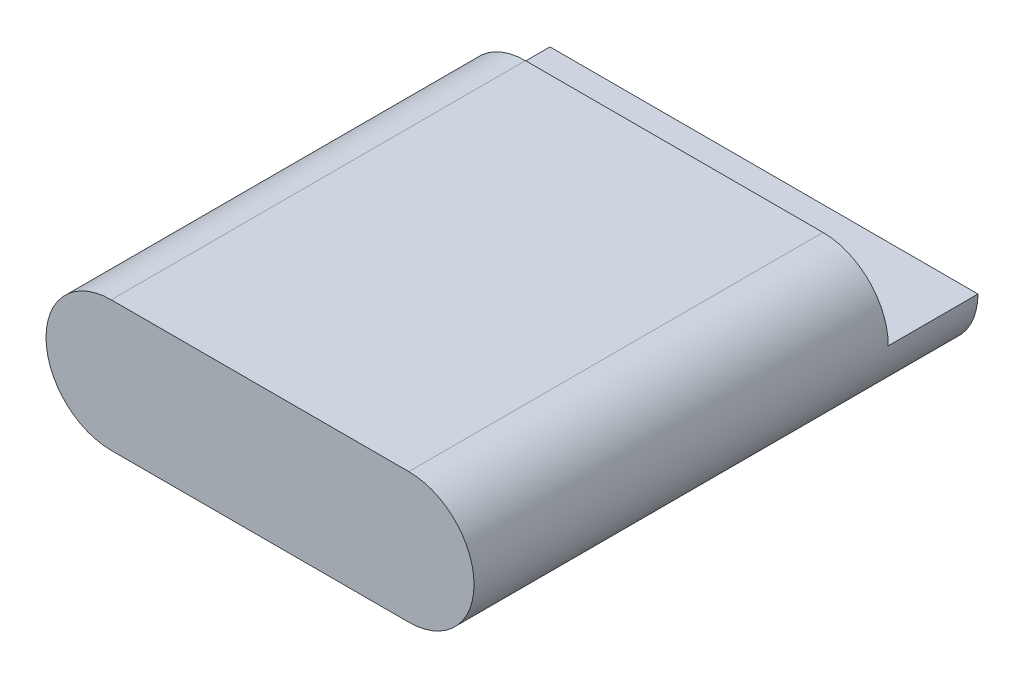
ISO-10303-21;
HEADER;
FILE_DESCRIPTION(('STEP AP214'),'2;1');
FILE_NAME('part.step','',(''),(''),'','','');
FILE_SCHEMA(('AUTOMOTIVE_DESIGN { 1 0 10303 214 1 1 1 1 }'));
ENDSEC;
DATA;
#1=APPLICATION_CONTEXT('core data for automotive mechanical design processes');
#2=APPLICATION_PROTOCOL_DEFINITION('international standard','automotive_design',2000,#1);
#3=PRODUCT_CONTEXT('',#1,'mechanical');
#4=PRODUCT('Part','Part','',(#3));
#5=PRODUCT_RELATED_PRODUCT_CATEGORY('part','',(#4));
#6=PRODUCT_DEFINITION_FORMATION('','',#4);
#7=PRODUCT_DEFINITION_CONTEXT('part definition',#1,'design');
#8=PRODUCT_DEFINITION('design','',#6,#7);
#9=PRODUCT_DEFINITION_SHAPE('','',#8);
#10=(LENGTH_UNIT() NAMED_UNIT(*) SI_UNIT(.MILLI.,.METRE.));
#11=(NAMED_UNIT(*) PLANE_ANGLE_UNIT() SI_UNIT($,.RADIAN.));
#12=(NAMED_UNIT(*) SI_UNIT($,.STERADIAN.) SOLID_ANGLE_UNIT());
#13=UNCERTAINTY_MEASURE_WITH_UNIT(LENGTH_MEASURE(1.E-05),#10,'distance_accuracy_value','');
#14=(GEOMETRIC_REPRESENTATION_CONTEXT(3) GLOBAL_UNCERTAINTY_ASSIGNED_CONTEXT((#13)) GLOBAL_UNIT_ASSIGNED_CONTEXT((#10,
#11,#12)) REPRESENTATION_CONTEXT('',''));
#15=CARTESIAN_POINT('',(0.,0.,0.));
#16=DIRECTION('',(0.,0.,1.));
#17=DIRECTION('',(1.,0.,0.));
#18=AXIS2_PLACEMENT_3D('',#15,#16,#17);
#19=CARTESIAN_POINT('',(-10.775,4.725,36.5));
#20=DIRECTION('',(0.,-1.,0.));
#21=DIRECTION('',(0.,0.,-1.));
#22=AXIS2_PLACEMENT_3D('',#19,#20,#21);
#23=PLANE('',#22);
#24=DIRECTION('',(1.,0.,0.));
#25=VECTOR('',#24,1.);
#26=CARTESIAN_POINT('',(10.775,4.725,6.5));
#27=LINE('',#26,#25);
#28=CARTESIAN_POINT('',(-10.775,4.725,6.5));
#29=VERTEX_POINT('',#28);
#30=CARTESIAN_POINT('',(10.775,4.725,6.5));
#31=VERTEX_POINT('',#30);
#32=EDGE_CURVE('E109',#29,#31,#27,.T.);
#33=ORIENTED_EDGE('',*,*,#32,.F.);
#34=DIRECTION('',(0.,0.,-1.));
#35=VECTOR('',#34,1.);
#36=CARTESIAN_POINT('',(-10.775,4.725,36.5));
#37=LINE('',#36,#35);
#38=CARTESIAN_POINT('',(-10.775,4.725,36.5));
#39=VERTEX_POINT('',#38);
#40=EDGE_CURVE('E131',#39,#29,#37,.T.);
#41=ORIENTED_EDGE('',*,*,#40,.F.);
#42=DIRECTION('',(-1.,0.,0.));
#43=VECTOR('',#42,1.);
#44=CARTESIAN_POINT('',(-10.775,4.725,36.5));
#45=LINE('',#44,#43);
#46=CARTESIAN_POINT('',(10.775,4.725,36.5));
#47=VERTEX_POINT('',#46);
#48=EDGE_CURVE('E62',#47,#39,#45,.T.);
#49=ORIENTED_EDGE('',*,*,#48,.F.);
#50=DIRECTION('',(0.,0.,-1.));
#51=VECTOR('',#50,1.);
#52=CARTESIAN_POINT('',(10.775,4.725,36.5));
#53=LINE('',#52,#51);
#54=EDGE_CURVE('E137',#47,#31,#53,.T.);
#55=ORIENTED_EDGE('',*,*,#54,.T.);
#56=EDGE_LOOP('',(#33,#41,#49,#55));
#57=FACE_BOUND('',#56,.T.);
#58=ADVANCED_FACE('F38',(#57),#23,.F.);
#59=CARTESIAN_POINT('',(-10.775,0.,36.5));
#60=DIRECTION('',(0.,0.,-1.));
#61=DIRECTION('',(-1.,0.,0.));
#62=AXIS2_PLACEMENT_3D('',#59,#60,#61);
#63=CYLINDRICAL_SURFACE('',#62,4.725);
#64=CARTESIAN_POINT('',(-10.775,0.,6.5));
#65=DIRECTION('',(0.,0.,-1.));
#66=DIRECTION('',(1.,0.,0.));
#67=AXIS2_PLACEMENT_3D('',#64,#65,#66);
#68=CIRCLE('',#67,4.72500000000001);
#69=CARTESIAN_POINT('',(-15.499933861971,-0.0249999999999926,6.5));
#70=VERTEX_POINT('',#69);
#71=EDGE_CURVE('E103',#70,#29,#68,.T.);
#72=ORIENTED_EDGE('',*,*,#71,.F.);
#73=DIRECTION('',(0.,0.,-1.));
#74=VECTOR('',#73,1.);
#75=CARTESIAN_POINT('',(-15.499933861971,-0.0249999999999926,6.5));
#76=LINE('',#75,#74);
#77=CARTESIAN_POINT('',(-15.499933861971,-0.0249999999999926,0.));
#78=VERTEX_POINT('',#77);
#79=EDGE_CURVE('E100',#70,#78,#76,.T.);
#80=ORIENTED_EDGE('',*,*,#79,.T.);
#81=CARTESIAN_POINT('',(-10.775,0.,0.));
#82=DIRECTION('',(0.,0.,1.));
#83=DIRECTION('',(1.,0.,0.));
#84=AXIS2_PLACEMENT_3D('',#81,#82,#83);
#85=CIRCLE('',#84,4.725);
#86=CARTESIAN_POINT('',(-10.775,-4.725,0.));
#87=VERTEX_POINT('',#86);
#88=EDGE_CURVE('E120',#78,#87,#85,.T.);
#89=ORIENTED_EDGE('',*,*,#88,.T.);
#90=DIRECTION('',(0.,0.,-1.));
#91=VECTOR('',#90,1.);
#92=CARTESIAN_POINT('',(-10.775,-4.725,36.5));
#93=LINE('',#92,#91);
#94=CARTESIAN_POINT('',(-10.775,-4.725,36.5));
#95=VERTEX_POINT('',#94);
#96=EDGE_CURVE('E11',#95,#87,#93,.T.);
#97=ORIENTED_EDGE('',*,*,#96,.F.);
#98=CARTESIAN_POINT('',(-10.775,0.,36.5));
#99=DIRECTION('',(0.,0.,1.));
#100=DIRECTION('',(1.,0.,0.));
#101=AXIS2_PLACEMENT_3D('',#98,#99,#100);
#102=CIRCLE('',#101,4.725);
#103=EDGE_CURVE('E125',#39,#95,#102,.T.);
#104=ORIENTED_EDGE('',*,*,#103,.F.);
#105=ORIENTED_EDGE('',*,*,#40,.T.);
#106=EDGE_LOOP('',(#72,#80,#89,#97,#104,#105));
#107=FACE_BOUND('',#106,.T.);
#108=ADVANCED_FACE('F40',(#107),#63,.T.);
#109=CARTESIAN_POINT('',(-10.775,-4.725,36.5));
#110=DIRECTION('',(0.,1.,0.));
#111=DIRECTION('',(0.,0.,1.));
#112=AXIS2_PLACEMENT_3D('',#109,#110,#111);
#113=PLANE('',#112);
#114=DIRECTION('',(1.,0.,0.));
#115=VECTOR('',#114,1.);
#116=CARTESIAN_POINT('',(-10.775,-4.725,0.));
#117=LINE('',#116,#115);
#118=CARTESIAN_POINT('',(10.775,-4.72500000000001,0.));
#119=VERTEX_POINT('',#118);
#120=EDGE_CURVE('E77',#87,#119,#117,.T.);
#121=ORIENTED_EDGE('',*,*,#120,.T.);
#122=DIRECTION('',(0.,0.,-1.));
#123=VECTOR('',#122,1.);
#124=CARTESIAN_POINT('',(10.775,-4.72500000000001,36.5));
#125=LINE('',#124,#123);
#126=CARTESIAN_POINT('',(10.775,-4.72500000000001,36.5));
#127=VERTEX_POINT('',#126);
#128=EDGE_CURVE('E46',#127,#119,#125,.T.);
#129=ORIENTED_EDGE('',*,*,#128,.F.);
#130=DIRECTION('',(1.,0.,0.));
#131=VECTOR('',#130,1.);
#132=CARTESIAN_POINT('',(-10.775,-4.725,36.5));
#133=LINE('',#132,#131);
#134=EDGE_CURVE('E82',#95,#127,#133,.T.);
#135=ORIENTED_EDGE('',*,*,#134,.F.);
#136=ORIENTED_EDGE('',*,*,#96,.T.);
#137=EDGE_LOOP('',(#121,#129,#135,#136));
#138=FACE_BOUND('',#137,.T.);
#139=ADVANCED_FACE('F155',(#138),#113,.F.);
#140=CARTESIAN_POINT('',(10.775,0.,36.5));
#141=DIRECTION('',(0.,0.,-1.));
#142=DIRECTION('',(-1.,0.,0.));
#143=AXIS2_PLACEMENT_3D('',#140,#141,#142);
#144=CYLINDRICAL_SURFACE('',#143,4.725);
#145=CARTESIAN_POINT('',(10.775,0.,0.));
#146=DIRECTION('',(0.,0.,1.));
#147=DIRECTION('',(1.,0.,0.));
#148=AXIS2_PLACEMENT_3D('',#145,#146,#147);
#149=CIRCLE('',#148,4.725);
#150=CARTESIAN_POINT('',(15.499933861971,-0.0249999999999946,0.));
#151=VERTEX_POINT('',#150);
#152=EDGE_CURVE('E118',#119,#151,#149,.T.);
#153=ORIENTED_EDGE('',*,*,#152,.T.);
#154=DIRECTION('',(0.,0.,-1.));
#155=VECTOR('',#154,1.);
#156=CARTESIAN_POINT('',(15.499933861971,-0.0249999999999946,6.5));
#157=LINE('',#156,#155);
#158=CARTESIAN_POINT('',(15.499933861971,-0.0249999999999946,6.5));
#159=VERTEX_POINT('',#158);
#160=EDGE_CURVE('E53',#159,#151,#157,.T.);
#161=ORIENTED_EDGE('',*,*,#160,.F.);
#162=CARTESIAN_POINT('',(10.775,0.,6.5));
#163=DIRECTION('',(0.,0.,-1.));
#164=DIRECTION('',(-1.,0.,0.));
#165=AXIS2_PLACEMENT_3D('',#162,#163,#164);
#166=CIRCLE('',#165,4.72500000000001);
#167=EDGE_CURVE('E104',#31,#159,#166,.T.);
#168=ORIENTED_EDGE('',*,*,#167,.F.);
#169=ORIENTED_EDGE('',*,*,#54,.F.);
#170=CARTESIAN_POINT('',(10.775,0.,36.5));
#171=DIRECTION('',(0.,0.,1.));
#172=DIRECTION('',(1.,0.,0.));
#173=AXIS2_PLACEMENT_3D('',#170,#171,#172);
#174=CIRCLE('',#173,4.725);
#175=EDGE_CURVE('E128',#127,#47,#174,.T.);
#176=ORIENTED_EDGE('',*,*,#175,.F.);
#177=ORIENTED_EDGE('',*,*,#128,.T.);
#178=EDGE_LOOP('',(#153,#161,#168,#169,#176,#177));
#179=FACE_BOUND('',#178,.T.);
#180=ADVANCED_FACE('F116',(#179),#144,.T.);
#181=CARTESIAN_POINT('',(-10.775,0.,36.5));
#182=DIRECTION('',(0.,0.,1.));
#183=DIRECTION('',(1.,0.,0.));
#184=AXIS2_PLACEMENT_3D('',#181,#182,#183);
#185=PLANE('',#184);
#186=ORIENTED_EDGE('',*,*,#103,.T.);
#187=ORIENTED_EDGE('',*,*,#134,.T.);
#188=ORIENTED_EDGE('',*,*,#175,.T.);
#189=ORIENTED_EDGE('',*,*,#48,.T.);
#190=EDGE_LOOP('',(#186,#187,#188,#189));
#191=FACE_BOUND('',#190,.T.);
#192=ADVANCED_FACE('F147',(#191),#185,.T.);
#193=CARTESIAN_POINT('',(-10.775,0.,0.));
#194=DIRECTION('',(0.,0.,1.));
#195=DIRECTION('',(1.,0.,0.));
#196=AXIS2_PLACEMENT_3D('',#193,#194,#195);
#197=PLANE('',#196);
#198=ORIENTED_EDGE('',*,*,#88,.F.);
#199=DIRECTION('',(-1.,0.,0.));
#200=VECTOR('',#199,1.);
#201=CARTESIAN_POINT('',(15.499933861971,-0.0249999999999946,0.));
#202=LINE('',#201,#200);
#203=EDGE_CURVE('E113',#151,#78,#202,.T.);
#204=ORIENTED_EDGE('',*,*,#203,.F.);
#205=ORIENTED_EDGE('',*,*,#152,.F.);
#206=ORIENTED_EDGE('',*,*,#120,.F.);
#207=EDGE_LOOP('',(#198,#204,#205,#206));
#208=FACE_BOUND('',#207,.T.);
#209=ADVANCED_FACE('F141',(#208),#197,.F.);
#210=CARTESIAN_POINT('',(15.499933861971,-0.0249999999999946,6.5));
#211=DIRECTION('',(0.,-1.,0.));
#212=DIRECTION('',(0.,0.,-1.));
#213=AXIS2_PLACEMENT_3D('',#210,#211,#212);
#214=PLANE('',#213);
#215=ORIENTED_EDGE('',*,*,#203,.T.);
#216=ORIENTED_EDGE('',*,*,#79,.F.);
#217=DIRECTION('',(-1.,0.,0.));
#218=VECTOR('',#217,1.);
#219=CARTESIAN_POINT('',(15.499933861971,-0.0249999999999946,6.5));
#220=LINE('',#219,#218);
#221=EDGE_CURVE('E96',#159,#70,#220,.T.);
#222=ORIENTED_EDGE('',*,*,#221,.F.);
#223=ORIENTED_EDGE('',*,*,#160,.T.);
#224=EDGE_LOOP('',(#215,#216,#222,#223));
#225=FACE_BOUND('',#224,.T.);
#226=ADVANCED_FACE('F98',(#225),#214,.F.);
#227=CARTESIAN_POINT('',(10.775,0.,6.5));
#228=DIRECTION('',(0.,0.,-1.));
#229=DIRECTION('',(-1.,0.,0.));
#230=AXIS2_PLACEMENT_3D('',#227,#228,#229);
#231=PLANE('',#230);
#232=ORIENTED_EDGE('',*,*,#167,.T.);
#233=ORIENTED_EDGE('',*,*,#221,.T.);
#234=ORIENTED_EDGE('',*,*,#71,.T.);
#235=ORIENTED_EDGE('',*,*,#32,.T.);
#236=EDGE_LOOP('',(#232,#233,#234,#235));
#237=FACE_BOUND('',#236,.T.);
#238=ADVANCED_FACE('F107',(#237),#231,.T.);
#239=CLOSED_SHELL('',(#58,#108,#139,#180,#192,#209,#226,#238));
#240=MANIFOLD_SOLID_BREP('B2',#239);
#241=ADVANCED_BREP_SHAPE_REPRESENTATION('',(#18,#240),#14);
#242=SHAPE_DEFINITION_REPRESENTATION(#9,#241);
ENDSEC;
END-ISO-10303-21;
